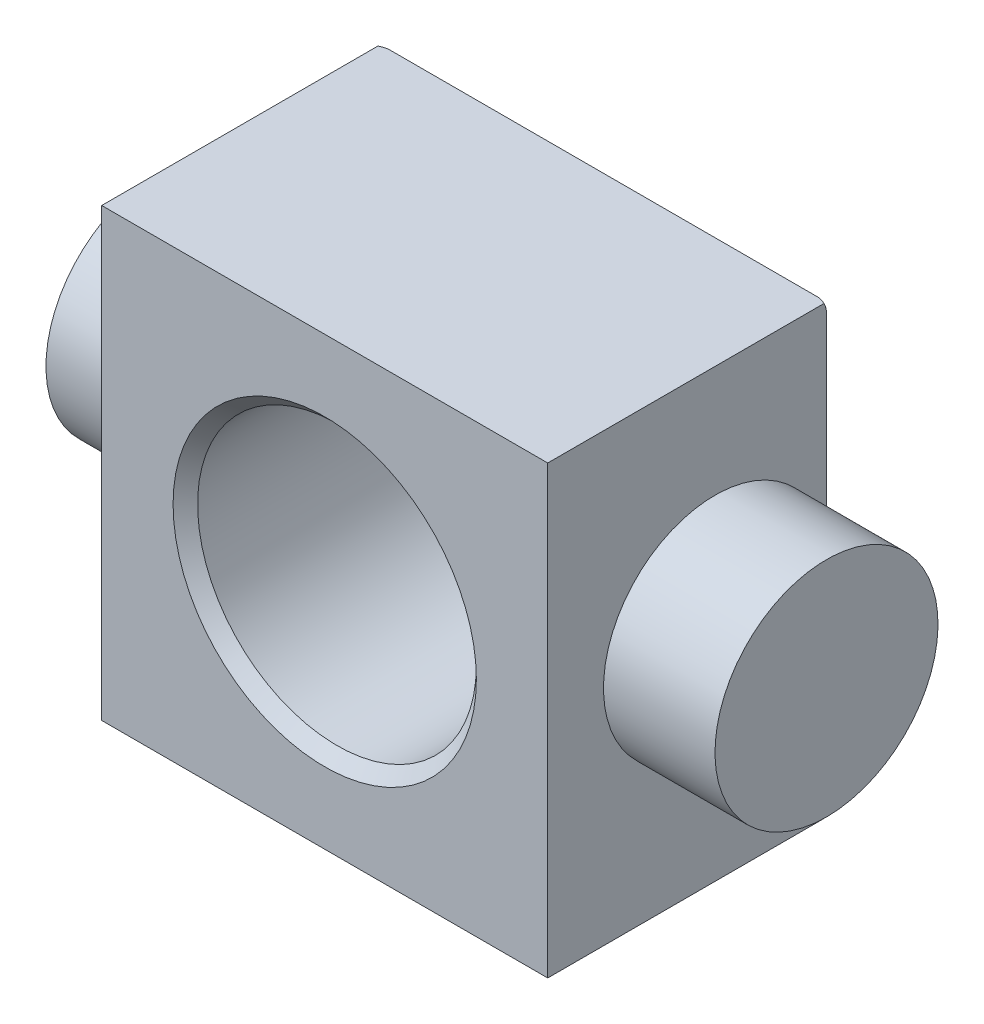
ISO-10303-21;
HEADER;
FILE_DESCRIPTION(('STEP AP214'),'2;1');
FILE_NAME('part.step','',(''),(''),'','','');
FILE_SCHEMA(('AUTOMOTIVE_DESIGN { 1 0 10303 214 1 1 1 1 }'));
ENDSEC;
DATA;
#1=APPLICATION_CONTEXT('core data for automotive mechanical design processes');
#2=APPLICATION_PROTOCOL_DEFINITION('international standard','automotive_design',2000,#1);
#3=PRODUCT_CONTEXT('',#1,'mechanical');
#4=PRODUCT('Part','Part','',(#3));
#5=PRODUCT_RELATED_PRODUCT_CATEGORY('part','',(#4));
#6=PRODUCT_DEFINITION_FORMATION('','',#4);
#7=PRODUCT_DEFINITION_CONTEXT('part definition',#1,'design');
#8=PRODUCT_DEFINITION('design','',#6,#7);
#9=PRODUCT_DEFINITION_SHAPE('','',#8);
#10=(LENGTH_UNIT() NAMED_UNIT(*) SI_UNIT(.MILLI.,.METRE.));
#11=(NAMED_UNIT(*) PLANE_ANGLE_UNIT() SI_UNIT($,.RADIAN.));
#12=(NAMED_UNIT(*) SI_UNIT($,.STERADIAN.) SOLID_ANGLE_UNIT());
#13=UNCERTAINTY_MEASURE_WITH_UNIT(LENGTH_MEASURE(1.E-05),#10,'distance_accuracy_value','');
#14=(GEOMETRIC_REPRESENTATION_CONTEXT(3) GLOBAL_UNCERTAINTY_ASSIGNED_CONTEXT((#13)) GLOBAL_UNIT_ASSIGNED_CONTEXT((#10,
#11,#12)) REPRESENTATION_CONTEXT('',''));
#15=CARTESIAN_POINT('',(0.,0.,0.));
#16=DIRECTION('',(0.,0.,1.));
#17=DIRECTION('',(1.,0.,0.));
#18=AXIS2_PLACEMENT_3D('',#15,#16,#17);
#19=CARTESIAN_POINT('',(-12.7,12.7,9.525));
#20=DIRECTION('',(1.,0.,0.));
#21=DIRECTION('',(0.,0.,-1.));
#22=AXIS2_PLACEMENT_3D('',#19,#20,#21);
#23=PLANE('',#22);
#24=DIRECTION('',(0.,0.,-1.));
#25=VECTOR('',#24,1.);
#26=CARTESIAN_POINT('',(-12.7,12.7,9.525));
#27=LINE('',#26,#25);
#28=CARTESIAN_POINT('',(-12.7,12.7,9.525));
#29=VERTEX_POINT('',#28);
#30=CARTESIAN_POINT('',(-12.7,12.7,-6.20562485747209));
#31=VERTEX_POINT('',#30);
#32=EDGE_CURVE('E273',#29,#31,#27,.T.);
#33=ORIENTED_EDGE('',*,*,#32,.T.);
#34=CARTESIAN_POINT('',(-12.7,12.7,-5.2723692654717));
#35=DIRECTION('',(1.,0.,0.));
#36=DIRECTION('',(0.,0.707106781186549,0.707106781186546));
#37=AXIS2_PLACEMENT_3D('',#34,#35,#36);
#38=ELLIPSE('',#37,1.31982271536748,0.762);
#39=CARTESIAN_POINT('',(-12.7,12.1611846327359,-6.35));
#40=VERTEX_POINT('',#39);
#41=EDGE_CURVE('E225',#31,#40,#38,.F.);
#42=ORIENTED_EDGE('',*,*,#41,.T.);
#43=DIRECTION('',(0.,-1.,0.));
#44=VECTOR('',#43,1.);
#45=CARTESIAN_POINT('',(-12.7,12.7,-6.35));
#46=LINE('',#45,#44);
#47=CARTESIAN_POINT('',(-12.7,0.,-6.35));
#48=VERTEX_POINT('',#47);
#49=EDGE_CURVE('E193',#40,#48,#46,.T.);
#50=ORIENTED_EDGE('',*,*,#49,.T.);
#51=CARTESIAN_POINT('',(-12.7,0.,0.));
#52=DIRECTION('',(1.,0.,0.));
#53=DIRECTION('',(0.,0.,-1.));
#54=AXIS2_PLACEMENT_3D('',#51,#52,#53);
#55=CIRCLE('',#54,6.35);
#56=EDGE_CURVE('E163',#48,#48,#55,.F.);
#57=ORIENTED_EDGE('',*,*,#56,.F.);
#58=DIRECTION('',(0.,-1.,0.));
#59=VECTOR('',#58,1.);
#60=CARTESIAN_POINT('',(-12.7,12.7,-6.35));
#61=LINE('',#60,#59);
#62=CARTESIAN_POINT('',(-12.7,-12.1611846327359,-6.35));
#63=VERTEX_POINT('',#62);
#64=EDGE_CURVE('E191',#48,#63,#61,.T.);
#65=ORIENTED_EDGE('',*,*,#64,.T.);
#66=CARTESIAN_POINT('',(-12.7,-12.7,-5.2723692654717));
#67=DIRECTION('',(1.,0.,0.));
#68=DIRECTION('',(0.,0.707106781186549,-0.707106781186546));
#69=AXIS2_PLACEMENT_3D('',#66,#67,#68);
#70=ELLIPSE('',#69,1.31982271536748,0.762);
#71=CARTESIAN_POINT('',(-12.7,-12.7,-6.20562485747209));
#72=VERTEX_POINT('',#71);
#73=EDGE_CURVE('E162',#63,#72,#70,.F.);
#74=ORIENTED_EDGE('',*,*,#73,.T.);
#75=DIRECTION('',(0.,0.,-1.));
#76=VECTOR('',#75,1.);
#77=CARTESIAN_POINT('',(-12.7,-12.7,9.525));
#78=LINE('',#77,#76);
#79=CARTESIAN_POINT('',(-12.7,-12.7,9.525));
#80=VERTEX_POINT('',#79);
#81=EDGE_CURVE('E143',#80,#72,#78,.T.);
#82=ORIENTED_EDGE('',*,*,#81,.F.);
#83=DIRECTION('',(0.,-1.,0.));
#84=VECTOR('',#83,1.);
#85=CARTESIAN_POINT('',(-12.7,12.7,9.525));
#86=LINE('',#85,#84);
#87=EDGE_CURVE('E149',#29,#80,#86,.T.);
#88=ORIENTED_EDGE('',*,*,#87,.F.);
#89=EDGE_LOOP('',(#33,#42,#50,#57,#65,#74,#82,#88));
#90=FACE_BOUND('',#89,.T.);
#91=ADVANCED_FACE('F46',(#90),#23,.F.);
#92=CARTESIAN_POINT('',(-12.7,-12.7,9.525));
#93=DIRECTION('',(0.,1.,0.));
#94=DIRECTION('',(0.,0.,1.));
#95=AXIS2_PLACEMENT_3D('',#92,#93,#94);
#96=PLANE('',#95);
#97=ORIENTED_EDGE('',*,*,#81,.T.);
#98=CARTESIAN_POINT('',(-12.7,-12.7,-5.2723692654717));
#99=DIRECTION('',(0.,1.,0.));
#100=DIRECTION('',(0.707106781186549,0.,-0.707106781186546));
#101=AXIS2_PLACEMENT_3D('',#98,#99,#100);
#102=ELLIPSE('',#101,1.31982271536748,0.762);
#103=CARTESIAN_POINT('',(-12.1611846327359,-12.7,-6.35));
#104=VERTEX_POINT('',#103);
#105=EDGE_CURVE('E13',#72,#104,#102,.F.);
#106=ORIENTED_EDGE('',*,*,#105,.T.);
#107=DIRECTION('',(1.,0.,0.));
#108=VECTOR('',#107,1.);
#109=CARTESIAN_POINT('',(-12.7,-12.7,-6.35));
#110=LINE('',#109,#108);
#111=CARTESIAN_POINT('',(12.1611846327359,-12.7,-6.35));
#112=VERTEX_POINT('',#111);
#113=EDGE_CURVE('E195',#104,#112,#110,.T.);
#114=ORIENTED_EDGE('',*,*,#113,.T.);
#115=CARTESIAN_POINT('',(12.7,-12.7,-5.2723692654717));
#116=DIRECTION('',(0.,1.,0.));
#117=DIRECTION('',(-0.707106781186549,0.,-0.707106781186547));
#118=AXIS2_PLACEMENT_3D('',#115,#116,#117);
#119=ELLIPSE('',#118,1.31982271536748,0.762);
#120=CARTESIAN_POINT('',(12.7,-12.7,-6.20562485747209));
#121=VERTEX_POINT('',#120);
#122=EDGE_CURVE('E54',#112,#121,#119,.F.);
#123=ORIENTED_EDGE('',*,*,#122,.T.);
#124=DIRECTION('',(0.,0.,-1.));
#125=VECTOR('',#124,1.);
#126=CARTESIAN_POINT('',(12.7,-12.7,9.525));
#127=LINE('',#126,#125);
#128=CARTESIAN_POINT('',(12.7,-12.7,9.525));
#129=VERTEX_POINT('',#128);
#130=EDGE_CURVE('E145',#129,#121,#127,.T.);
#131=ORIENTED_EDGE('',*,*,#130,.F.);
#132=DIRECTION('',(1.,0.,0.));
#133=VECTOR('',#132,1.);
#134=CARTESIAN_POINT('',(-12.7,-12.7,9.525));
#135=LINE('',#134,#133);
#136=EDGE_CURVE('E139',#80,#129,#135,.T.);
#137=ORIENTED_EDGE('',*,*,#136,.F.);
#138=EDGE_LOOP('',(#97,#106,#114,#123,#131,#137));
#139=FACE_BOUND('',#138,.T.);
#140=ADVANCED_FACE('F141',(#139),#96,.F.);
#141=CARTESIAN_POINT('',(12.7,12.7,9.525));
#142=DIRECTION('',(-1.,0.,0.));
#143=DIRECTION('',(0.,-1.,0.));
#144=AXIS2_PLACEMENT_3D('',#141,#142,#143);
#145=PLANE('',#144);
#146=DIRECTION('',(0.,1.,0.));
#147=VECTOR('',#146,1.);
#148=CARTESIAN_POINT('',(12.7,12.7,-6.35));
#149=LINE('',#148,#147);
#150=CARTESIAN_POINT('',(12.7,0.,-6.35));
#151=VERTEX_POINT('',#150);
#152=CARTESIAN_POINT('',(12.7,12.1611846327359,-6.35));
#153=VERTEX_POINT('',#152);
#154=EDGE_CURVE('E166',#151,#153,#149,.T.);
#155=ORIENTED_EDGE('',*,*,#154,.T.);
#156=CARTESIAN_POINT('',(12.7,12.7,-5.2723692654717));
#157=DIRECTION('',(-1.,0.,0.));
#158=DIRECTION('',(0.,0.707106781186549,0.707106781186546));
#159=AXIS2_PLACEMENT_3D('',#156,#157,#158);
#160=ELLIPSE('',#159,1.31982271536748,0.762);
#161=CARTESIAN_POINT('',(12.7,12.7,-6.20562485747209));
#162=VERTEX_POINT('',#161);
#163=EDGE_CURVE('E205',#153,#162,#160,.F.);
#164=ORIENTED_EDGE('',*,*,#163,.T.);
#165=DIRECTION('',(0.,0.,-1.));
#166=VECTOR('',#165,1.);
#167=CARTESIAN_POINT('',(12.7,12.7,9.525));
#168=LINE('',#167,#166);
#169=CARTESIAN_POINT('',(12.7,12.7,9.525));
#170=VERTEX_POINT('',#169);
#171=EDGE_CURVE('E168',#170,#162,#168,.T.);
#172=ORIENTED_EDGE('',*,*,#171,.F.);
#173=DIRECTION('',(0.,1.,0.));
#174=VECTOR('',#173,1.);
#175=CARTESIAN_POINT('',(12.7,12.7,9.525));
#176=LINE('',#175,#174);
#177=EDGE_CURVE('E148',#129,#170,#176,.T.);
#178=ORIENTED_EDGE('',*,*,#177,.F.);
#179=ORIENTED_EDGE('',*,*,#130,.T.);
#180=CARTESIAN_POINT('',(12.7,-12.7,-5.27236926547171));
#181=DIRECTION('',(-1.,0.,0.));
#182=DIRECTION('',(0.,0.707106781186549,-0.707106781186546));
#183=AXIS2_PLACEMENT_3D('',#180,#181,#182);
#184=ELLIPSE('',#183,1.31982271536748,0.762);
#185=CARTESIAN_POINT('',(12.7,-12.1611846327358,-6.35));
#186=VERTEX_POINT('',#185);
#187=EDGE_CURVE('E203',#121,#186,#184,.F.);
#188=ORIENTED_EDGE('',*,*,#187,.T.);
#189=DIRECTION('',(0.,1.,0.));
#190=VECTOR('',#189,1.);
#191=CARTESIAN_POINT('',(12.7,12.7,-6.35));
#192=LINE('',#191,#190);
#193=EDGE_CURVE('E174',#186,#151,#192,.T.);
#194=ORIENTED_EDGE('',*,*,#193,.T.);
#195=CARTESIAN_POINT('',(12.7,0.,0.));
#196=DIRECTION('',(-1.,0.,0.));
#197=DIRECTION('',(0.,-1.,0.));
#198=AXIS2_PLACEMENT_3D('',#195,#196,#197);
#199=CIRCLE('',#198,6.35);
#200=EDGE_CURVE('E258',#151,#151,#199,.T.);
#201=ORIENTED_EDGE('',*,*,#200,.T.);
#202=EDGE_LOOP('',(#155,#164,#172,#178,#179,#188,#194,#201));
#203=FACE_BOUND('',#202,.T.);
#204=ADVANCED_FACE('F238',(#203),#145,.F.);
#205=CARTESIAN_POINT('',(-12.7,12.7,9.525));
#206=DIRECTION('',(0.,-1.,0.));
#207=DIRECTION('',(0.,0.,-1.));
#208=AXIS2_PLACEMENT_3D('',#205,#206,#207);
#209=PLANE('',#208);
#210=ORIENTED_EDGE('',*,*,#171,.T.);
#211=CARTESIAN_POINT('',(12.7,12.7,-5.2723692654717));
#212=DIRECTION('',(0.,-1.,0.));
#213=DIRECTION('',(0.707106781186549,0.,0.707106781186547));
#214=AXIS2_PLACEMENT_3D('',#211,#212,#213);
#215=ELLIPSE('',#214,1.31982271536748,0.762);
#216=CARTESIAN_POINT('',(12.1611846327359,12.7,-6.35));
#217=VERTEX_POINT('',#216);
#218=EDGE_CURVE('E209',#162,#217,#215,.F.);
#219=ORIENTED_EDGE('',*,*,#218,.T.);
#220=DIRECTION('',(-1.,0.,0.));
#221=VECTOR('',#220,1.);
#222=CARTESIAN_POINT('',(-12.7,12.7,-6.35));
#223=LINE('',#222,#221);
#224=CARTESIAN_POINT('',(-12.1611846327359,12.7,-6.35));
#225=VERTEX_POINT('',#224);
#226=EDGE_CURVE('E188',#217,#225,#223,.T.);
#227=ORIENTED_EDGE('',*,*,#226,.T.);
#228=CARTESIAN_POINT('',(-12.7,12.7,-5.2723692654717));
#229=DIRECTION('',(0.,-1.,0.));
#230=DIRECTION('',(-0.707106781186549,0.,0.707106781186546));
#231=AXIS2_PLACEMENT_3D('',#228,#229,#230);
#232=ELLIPSE('',#231,1.31982271536748,0.762);
#233=EDGE_CURVE('E207',#225,#31,#232,.F.);
#234=ORIENTED_EDGE('',*,*,#233,.T.);
#235=ORIENTED_EDGE('',*,*,#32,.F.);
#236=DIRECTION('',(-1.,0.,0.));
#237=VECTOR('',#236,1.);
#238=CARTESIAN_POINT('',(-12.7,12.7,9.525));
#239=LINE('',#238,#237);
#240=EDGE_CURVE('E154',#170,#29,#239,.T.);
#241=ORIENTED_EDGE('',*,*,#240,.F.);
#242=EDGE_LOOP('',(#210,#219,#227,#234,#235,#241));
#243=FACE_BOUND('',#242,.T.);
#244=ADVANCED_FACE('F275',(#243),#209,.F.);
#245=CARTESIAN_POINT('',(-12.7,-12.7,9.525));
#246=DIRECTION('',(0.,0.,1.));
#247=DIRECTION('',(1.,0.,0.));
#248=AXIS2_PLACEMENT_3D('',#245,#246,#247);
#249=PLANE('',#248);
#250=CARTESIAN_POINT('',(0.,0.,9.525));
#251=DIRECTION('',(0.,0.,1.));
#252=DIRECTION('',(1.,0.,0.));
#253=AXIS2_PLACEMENT_3D('',#250,#251,#252);
#254=CIRCLE('',#253,8.636);
#255=CARTESIAN_POINT('',(8.636,0.,9.525));
#256=VERTEX_POINT('',#255);
#257=EDGE_CURVE('E471',#256,#256,#254,.T.);
#258=ORIENTED_EDGE('',*,*,#257,.F.);
#259=EDGE_LOOP('',(#258));
#260=FACE_BOUND('',#259,.T.);
#261=ORIENTED_EDGE('',*,*,#87,.T.);
#262=ORIENTED_EDGE('',*,*,#136,.T.);
#263=ORIENTED_EDGE('',*,*,#177,.T.);
#264=ORIENTED_EDGE('',*,*,#240,.T.);
#265=EDGE_LOOP('',(#261,#262,#263,#264));
#266=FACE_BOUND('',#265,.T.);
#267=ADVANCED_FACE('F152',(#260,#266),#249,.T.);
#268=CARTESIAN_POINT('',(-12.7,-12.7,-9.525));
#269=DIRECTION('',(0.,0.,1.));
#270=DIRECTION('',(1.,0.,0.));
#271=AXIS2_PLACEMENT_3D('',#268,#269,#270);
#272=PLANE('',#271);
#273=CARTESIAN_POINT('',(0.,0.,-9.525));
#274=DIRECTION('',(0.,0.,1.));
#275=DIRECTION('',(1.,0.,0.));
#276=AXIS2_PLACEMENT_3D('',#273,#274,#275);
#277=CIRCLE('',#276,7.93749999999999);
#278=CARTESIAN_POINT('',(7.93749999999999,0.,-9.525));
#279=VERTEX_POINT('',#278);
#280=EDGE_CURVE('E261',#279,#279,#277,.T.);
#281=ORIENTED_EDGE('',*,*,#280,.T.);
#282=EDGE_LOOP('',(#281));
#283=FACE_BOUND('',#282,.T.);
#284=DIRECTION('',(1.,0.,0.));
#285=VECTOR('',#284,1.);
#286=CARTESIAN_POINT('',(-12.7,9.52499999999999,-9.525));
#287=LINE('',#286,#285);
#288=CARTESIAN_POINT('',(-8.98618463273584,9.52499999999999,-9.525));
#289=VERTEX_POINT('',#288);
#290=CARTESIAN_POINT('',(8.98618463273584,9.52499999999999,-9.525));
#291=VERTEX_POINT('',#290);
#292=EDGE_CURVE('E182',#289,#291,#287,.T.);
#293=ORIENTED_EDGE('',*,*,#292,.T.);
#294=CARTESIAN_POINT('',(8.44736926547169,8.44736926547169,-9.525));
#295=DIRECTION('',(0.,0.,1.));
#296=DIRECTION('',(0.707106781186547,0.707106781186548,0.));
#297=AXIS2_PLACEMENT_3D('',#294,#295,#296);
#298=ELLIPSE('',#297,1.31982271536749,0.762);
#299=CARTESIAN_POINT('',(9.52499999999999,8.98618463273584,-9.525));
#300=VERTEX_POINT('',#299);
#301=EDGE_CURVE('E222',#291,#300,#298,.F.);
#302=ORIENTED_EDGE('',*,*,#301,.T.);
#303=DIRECTION('',(0.,-1.,0.));
#304=VECTOR('',#303,1.);
#305=CARTESIAN_POINT('',(9.52499999999999,-12.7,-9.525));
#306=LINE('',#305,#304);
#307=CARTESIAN_POINT('',(9.52499999999999,-8.98618463273583,-9.525));
#308=VERTEX_POINT('',#307);
#309=EDGE_CURVE('E185',#300,#308,#306,.T.);
#310=ORIENTED_EDGE('',*,*,#309,.T.);
#311=CARTESIAN_POINT('',(8.44736926547169,-8.44736926547168,-9.525));
#312=DIRECTION('',(0.,0.,1.));
#313=DIRECTION('',(-0.707106781186547,0.707106781186548,0.));
#314=AXIS2_PLACEMENT_3D('',#311,#312,#313);
#315=ELLIPSE('',#314,1.31982271536749,0.762);
#316=CARTESIAN_POINT('',(8.98618463273585,-9.52499999999999,-9.525));
#317=VERTEX_POINT('',#316);
#318=EDGE_CURVE('E216',#308,#317,#315,.F.);
#319=ORIENTED_EDGE('',*,*,#318,.T.);
#320=DIRECTION('',(-1.,0.,0.));
#321=VECTOR('',#320,1.);
#322=CARTESIAN_POINT('',(-12.7,-9.52499999999999,-9.525));
#323=LINE('',#322,#321);
#324=CARTESIAN_POINT('',(-8.98618463273584,-9.52499999999999,-9.525));
#325=VERTEX_POINT('',#324);
#326=EDGE_CURVE('E176',#317,#325,#323,.T.);
#327=ORIENTED_EDGE('',*,*,#326,.T.);
#328=CARTESIAN_POINT('',(-8.44736926547169,-8.44736926547169,-9.525));
#329=DIRECTION('',(0.,0.,1.));
#330=DIRECTION('',(0.707106781186548,0.707106781186548,0.));
#331=AXIS2_PLACEMENT_3D('',#328,#329,#330);
#332=ELLIPSE('',#331,1.31982271536749,0.762);
#333=CARTESIAN_POINT('',(-9.52499999999999,-8.98618463273584,-9.525));
#334=VERTEX_POINT('',#333);
#335=EDGE_CURVE('E218',#325,#334,#332,.F.);
#336=ORIENTED_EDGE('',*,*,#335,.T.);
#337=DIRECTION('',(0.,1.,0.));
#338=VECTOR('',#337,1.);
#339=CARTESIAN_POINT('',(-9.52499999999999,-12.7,-9.525));
#340=LINE('',#339,#338);
#341=CARTESIAN_POINT('',(-9.52499999999999,8.98618463273584,-9.525));
#342=VERTEX_POINT('',#341);
#343=EDGE_CURVE('E179',#334,#342,#340,.T.);
#344=ORIENTED_EDGE('',*,*,#343,.T.);
#345=CARTESIAN_POINT('',(-8.44736926547169,8.44736926547169,-9.525));
#346=DIRECTION('',(0.,0.,1.));
#347=DIRECTION('',(-0.707106781186548,0.707106781186548,0.));
#348=AXIS2_PLACEMENT_3D('',#345,#346,#347);
#349=ELLIPSE('',#348,1.31982271536749,0.762);
#350=EDGE_CURVE('E220',#342,#289,#349,.F.);
#351=ORIENTED_EDGE('',*,*,#350,.T.);
#352=EDGE_LOOP('',(#293,#302,#310,#319,#327,#336,#344,#351));
#353=FACE_BOUND('',#352,.T.);
#354=ADVANCED_FACE('F248',(#283,#353),#272,.F.);
#355=CARTESIAN_POINT('',(-19.05,0.,0.));
#356=DIRECTION('',(1.,0.,0.));
#357=DIRECTION('',(0.,1.,0.));
#358=AXIS2_PLACEMENT_3D('',#355,#356,#357);
#359=CYLINDRICAL_SURFACE('',#358,6.35);
#360=CARTESIAN_POINT('',(-19.05,0.,0.));
#361=DIRECTION('',(-1.,0.,0.));
#362=DIRECTION('',(0.,-1.,0.));
#363=AXIS2_PLACEMENT_3D('',#360,#361,#362);
#364=CIRCLE('',#363,6.35);
#365=CARTESIAN_POINT('',(-19.05,-6.35,0.));
#366=VERTEX_POINT('',#365);
#367=EDGE_CURVE('E158',#366,#366,#364,.T.);
#368=ORIENTED_EDGE('',*,*,#367,.F.);
#369=EDGE_LOOP('',(#368));
#370=FACE_BOUND('',#369,.T.);
#371=ORIENTED_EDGE('',*,*,#56,.T.);
#372=EDGE_LOOP('',(#371));
#373=FACE_BOUND('',#372,.T.);
#374=ADVANCED_FACE('F338',(#370,#373),#359,.T.);
#375=CARTESIAN_POINT('',(-19.05,0.,0.));
#376=DIRECTION('',(-1.,0.,0.));
#377=DIRECTION('',(0.,-1.,0.));
#378=AXIS2_PLACEMENT_3D('',#375,#376,#377);
#379=PLANE('',#378);
#380=ORIENTED_EDGE('',*,*,#367,.T.);
#381=EDGE_LOOP('',(#380));
#382=FACE_BOUND('',#381,.T.);
#383=ADVANCED_FACE('F334',(#382),#379,.T.);
#384=CARTESIAN_POINT('',(19.05,0.,0.));
#385=DIRECTION('',(-1.,0.,0.));
#386=DIRECTION('',(0.,-1.,0.));
#387=AXIS2_PLACEMENT_3D('',#384,#385,#386);
#388=CYLINDRICAL_SURFACE('',#387,6.35);
#389=CARTESIAN_POINT('',(19.05,0.,0.));
#390=DIRECTION('',(-1.,0.,0.));
#391=DIRECTION('',(0.,-1.,0.));
#392=AXIS2_PLACEMENT_3D('',#389,#390,#391);
#393=CIRCLE('',#392,6.35);
#394=CARTESIAN_POINT('',(19.05,-6.35,0.));
#395=VERTEX_POINT('',#394);
#396=EDGE_CURVE('E260',#395,#395,#393,.T.);
#397=ORIENTED_EDGE('',*,*,#396,.T.);
#398=EDGE_LOOP('',(#397));
#399=FACE_BOUND('',#398,.T.);
#400=ORIENTED_EDGE('',*,*,#200,.F.);
#401=EDGE_LOOP('',(#400));
#402=FACE_BOUND('',#401,.T.);
#403=ADVANCED_FACE('F330',(#399,#402),#388,.T.);
#404=CARTESIAN_POINT('',(19.05,0.,0.));
#405=DIRECTION('',(1.,0.,0.));
#406=DIRECTION('',(0.,-1.,0.));
#407=AXIS2_PLACEMENT_3D('',#404,#405,#406);
#408=PLANE('',#407);
#409=ORIENTED_EDGE('',*,*,#396,.F.);
#410=EDGE_LOOP('',(#409));
#411=FACE_BOUND('',#410,.T.);
#412=ADVANCED_FACE('F302',(#411),#408,.T.);
#413=CARTESIAN_POINT('',(-12.7,12.7,-6.35));
#414=DIRECTION('',(0.707106781186546,0.,0.707106781186549));
#415=DIRECTION('',(0.707106781186549,0.,-0.707106781186546));
#416=AXIS2_PLACEMENT_3D('',#413,#414,#415);
#417=PLANE('',#416);
#418=ORIENTED_EDGE('',*,*,#49,.F.);
#419=DIRECTION('',(0.577350269189626,-0.577350269189626,-0.577350269189625));
#420=VECTOR('',#419,1.);
#421=CARTESIAN_POINT('',(-12.8796051224214,12.3407897551572,-6.17039487757862));
#422=LINE('',#421,#420);
#423=EDGE_CURVE('E229',#40,#342,#422,.T.);
#424=ORIENTED_EDGE('',*,*,#423,.T.);
#425=ORIENTED_EDGE('',*,*,#343,.F.);
#426=DIRECTION('',(-0.577350269189626,-0.577350269189626,0.577350269189625));
#427=VECTOR('',#426,1.);
#428=CARTESIAN_POINT('',(-4.4129384557547,-3.87412308849055,-14.6370615442453));
#429=LINE('',#428,#427);
#430=EDGE_CURVE('E227',#334,#63,#429,.T.);
#431=ORIENTED_EDGE('',*,*,#430,.T.);
#432=ORIENTED_EDGE('',*,*,#64,.F.);
#433=EDGE_LOOP('',(#418,#424,#425,#431,#432));
#434=FACE_BOUND('',#433,.T.);
#435=ADVANCED_FACE('F286',(#434),#417,.F.);
#436=CARTESIAN_POINT('',(-12.7,-12.7,-6.35));
#437=DIRECTION('',(0.,0.707106781186546,0.707106781186549));
#438=DIRECTION('',(0.,-0.707106781186549,0.707106781186546));
#439=AXIS2_PLACEMENT_3D('',#436,#437,#438);
#440=PLANE('',#439);
#441=ORIENTED_EDGE('',*,*,#113,.F.);
#442=DIRECTION('',(-0.577350269189626,-0.577350269189626,0.577350269189625));
#443=VECTOR('',#442,1.);
#444=CARTESIAN_POINT('',(-12.3407897551572,-12.8796051224214,-6.17039487757862));
#445=LINE('',#444,#443);
#446=EDGE_CURVE('E232',#104,#325,#445,.F.);
#447=ORIENTED_EDGE('',*,*,#446,.T.);
#448=ORIENTED_EDGE('',*,*,#326,.F.);
#449=DIRECTION('',(0.577350269189626,-0.577350269189627,0.577350269189625));
#450=VECTOR('',#449,1.);
#451=CARTESIAN_POINT('',(3.87412308849056,-4.4129384557547,-14.6370615442453));
#452=LINE('',#451,#450);
#453=EDGE_CURVE('E61',#317,#112,#452,.T.);
#454=ORIENTED_EDGE('',*,*,#453,.T.);
#455=EDGE_LOOP('',(#441,#447,#448,#454));
#456=FACE_BOUND('',#455,.T.);
#457=ADVANCED_FACE('F292',(#456),#440,.F.);
#458=CARTESIAN_POINT('',(-12.7,12.7,-6.35));
#459=DIRECTION('',(0.,-0.707106781186546,0.707106781186549));
#460=DIRECTION('',(0.,-0.707106781186549,-0.707106781186546));
#461=AXIS2_PLACEMENT_3D('',#458,#459,#460);
#462=PLANE('',#461);
#463=ORIENTED_EDGE('',*,*,#226,.F.);
#464=DIRECTION('',(-0.577350269189626,-0.577350269189627,-0.577350269189625));
#465=VECTOR('',#464,1.);
#466=CARTESIAN_POINT('',(3.87412308849056,4.4129384557547,-14.6370615442453));
#467=LINE('',#466,#465);
#468=EDGE_CURVE('E214',#217,#291,#467,.T.);
#469=ORIENTED_EDGE('',*,*,#468,.T.);
#470=ORIENTED_EDGE('',*,*,#292,.F.);
#471=DIRECTION('',(0.577350269189626,-0.577350269189626,-0.577350269189625));
#472=VECTOR('',#471,1.);
#473=CARTESIAN_POINT('',(-12.3407897551572,12.8796051224214,-6.17039487757862));
#474=LINE('',#473,#472);
#475=EDGE_CURVE('E211',#289,#225,#474,.F.);
#476=ORIENTED_EDGE('',*,*,#475,.T.);
#477=EDGE_LOOP('',(#463,#469,#470,#476));
#478=FACE_BOUND('',#477,.T.);
#479=ADVANCED_FACE('F294',(#478),#462,.F.);
#480=CARTESIAN_POINT('',(12.7,12.7,-6.35));
#481=DIRECTION('',(-0.707106781186547,0.,0.707106781186549));
#482=DIRECTION('',(0.707106781186549,0.,0.707106781186547));
#483=AXIS2_PLACEMENT_3D('',#480,#481,#482);
#484=PLANE('',#483);
#485=ORIENTED_EDGE('',*,*,#309,.F.);
#486=DIRECTION('',(-0.577350269189626,-0.577350269189627,-0.577350269189625));
#487=VECTOR('',#486,1.);
#488=CARTESIAN_POINT('',(12.8796051224214,12.3407897551572,-6.17039487757862));
#489=LINE('',#488,#487);
#490=EDGE_CURVE('E200',#300,#153,#489,.F.);
#491=ORIENTED_EDGE('',*,*,#490,.T.);
#492=ORIENTED_EDGE('',*,*,#154,.F.);
#493=ORIENTED_EDGE('',*,*,#193,.F.);
#494=DIRECTION('',(0.577350269189626,-0.577350269189627,0.577350269189625));
#495=VECTOR('',#494,1.);
#496=CARTESIAN_POINT('',(4.4129384557547,-3.87412308849055,-14.6370615442453));
#497=LINE('',#496,#495);
#498=EDGE_CURVE('E197',#186,#308,#497,.F.);
#499=ORIENTED_EDGE('',*,*,#498,.T.);
#500=EDGE_LOOP('',(#485,#491,#492,#493,#499));
#501=FACE_BOUND('',#500,.T.);
#502=ADVANCED_FACE('F244',(#501),#484,.F.);
#503=CARTESIAN_POINT('',(0.,0.,9.525));
#504=DIRECTION('',(0.,0.,1.));
#505=DIRECTION('',(1.,0.,0.));
#506=AXIS2_PLACEMENT_3D('',#503,#504,#505);
#507=CYLINDRICAL_SURFACE('',#506,7.93749999999999);
#508=ORIENTED_EDGE('',*,*,#280,.F.);
#509=EDGE_LOOP('',(#508));
#510=FACE_BOUND('',#509,.T.);
#511=CARTESIAN_POINT('',(0.,0.,8.8265));
#512=DIRECTION('',(0.,0.,1.));
#513=DIRECTION('',(1.,0.,0.));
#514=AXIS2_PLACEMENT_3D('',#511,#512,#513);
#515=CIRCLE('',#514,7.9375);
#516=CARTESIAN_POINT('',(7.9375,0.,8.8265));
#517=VERTEX_POINT('',#516);
#518=EDGE_CURVE('E266',#517,#517,#515,.T.);
#519=ORIENTED_EDGE('',*,*,#518,.T.);
#520=EDGE_LOOP('',(#519));
#521=FACE_BOUND('',#520,.T.);
#522=ADVANCED_FACE('F313',(#510,#521),#507,.F.);
#523=CARTESIAN_POINT('',(0.,0.,9.525));
#524=DIRECTION('',(0.,0.,1.));
#525=DIRECTION('',(1.,0.,0.));
#526=AXIS2_PLACEMENT_3D('',#523,#524,#525);
#527=CONICAL_SURFACE('',#526,8.636,0.785398163397448);
#528=ORIENTED_EDGE('',*,*,#518,.F.);
#529=EDGE_LOOP('',(#528));
#530=FACE_BOUND('',#529,.T.);
#531=ORIENTED_EDGE('',*,*,#257,.T.);
#532=EDGE_LOOP('',(#531));
#533=FACE_BOUND('',#532,.T.);
#534=ADVANCED_FACE('F317',(#530,#533),#527,.F.);
#535=CARTESIAN_POINT('',(12.3407897551572,12.3407897551572,-5.63157951031447));
#536=DIRECTION('',(0.577350269189626,0.577350269189627,0.577350269189625));
#537=DIRECTION('',(-0.707106781186548,0.707106781186547,0.));
#538=AXIS2_PLACEMENT_3D('',#535,#536,#537);
#539=CYLINDRICAL_SURFACE('',#538,0.762);
#540=ORIENTED_EDGE('',*,*,#301,.F.);
#541=ORIENTED_EDGE('',*,*,#468,.F.);
#542=ORIENTED_EDGE('',*,*,#218,.F.);
#543=ORIENTED_EDGE('',*,*,#163,.F.);
#544=ORIENTED_EDGE('',*,*,#490,.F.);
#545=EDGE_LOOP('',(#540,#541,#542,#543,#544));
#546=FACE_BOUND('',#545,.T.);
#547=ADVANCED_FACE('F253',(#546),#539,.T.);
#548=CARTESIAN_POINT('',(-12.3407897551572,12.3407897551572,-5.63157951031447));
#549=DIRECTION('',(-0.577350269189626,0.577350269189626,0.577350269189625));
#550=DIRECTION('',(-0.707106781186547,-0.707106781186547,0.));
#551=AXIS2_PLACEMENT_3D('',#548,#549,#550);
#552=CYLINDRICAL_SURFACE('',#551,0.762);
#553=ORIENTED_EDGE('',*,*,#350,.F.);
#554=ORIENTED_EDGE('',*,*,#423,.F.);
#555=ORIENTED_EDGE('',*,*,#41,.F.);
#556=ORIENTED_EDGE('',*,*,#233,.F.);
#557=ORIENTED_EDGE('',*,*,#475,.F.);
#558=EDGE_LOOP('',(#553,#554,#555,#556,#557));
#559=FACE_BOUND('',#558,.T.);
#560=ADVANCED_FACE('F282',(#559),#552,.T.);
#561=CARTESIAN_POINT('',(-12.3407897551572,-12.3407897551572,-5.63157951031447));
#562=DIRECTION('',(0.577350269189626,0.577350269189626,-0.577350269189625));
#563=DIRECTION('',(-0.707106781186547,0.707106781186547,0.));
#564=AXIS2_PLACEMENT_3D('',#561,#562,#563);
#565=CYLINDRICAL_SURFACE('',#564,0.762);
#566=ORIENTED_EDGE('',*,*,#73,.F.);
#567=ORIENTED_EDGE('',*,*,#430,.F.);
#568=ORIENTED_EDGE('',*,*,#335,.F.);
#569=ORIENTED_EDGE('',*,*,#446,.F.);
#570=ORIENTED_EDGE('',*,*,#105,.F.);
#571=EDGE_LOOP('',(#566,#567,#568,#569,#570));
#572=FACE_BOUND('',#571,.T.);
#573=ADVANCED_FACE('F291',(#572),#565,.T.);
#574=CARTESIAN_POINT('',(3.87412308849056,-3.87412308849054,-14.0982461769811));
#575=DIRECTION('',(-0.577350269189626,0.577350269189627,-0.577350269189625));
#576=DIRECTION('',(-0.707106781186548,-0.707106781186547,0.));
#577=AXIS2_PLACEMENT_3D('',#574,#575,#576);
#578=CYLINDRICAL_SURFACE('',#577,0.762);
#579=ORIENTED_EDGE('',*,*,#122,.F.);
#580=ORIENTED_EDGE('',*,*,#453,.F.);
#581=ORIENTED_EDGE('',*,*,#318,.F.);
#582=ORIENTED_EDGE('',*,*,#498,.F.);
#583=ORIENTED_EDGE('',*,*,#187,.F.);
#584=EDGE_LOOP('',(#579,#580,#581,#582,#583));
#585=FACE_BOUND('',#584,.T.);
#586=ADVANCED_FACE('F48',(#585),#578,.T.);
#587=CLOSED_SHELL('',(#91,#140,#204,#244,#267,#354,#374,#383,#403,#412,#435,#457,#479,#502,#522,
#534,#547,#560,#573,#586));
#588=MANIFOLD_SOLID_BREP('B2',#587);
#589=ADVANCED_BREP_SHAPE_REPRESENTATION('',(#18,#588),#14);
#590=SHAPE_DEFINITION_REPRESENTATION(#9,#589);
ENDSEC;
END-ISO-10303-21;
